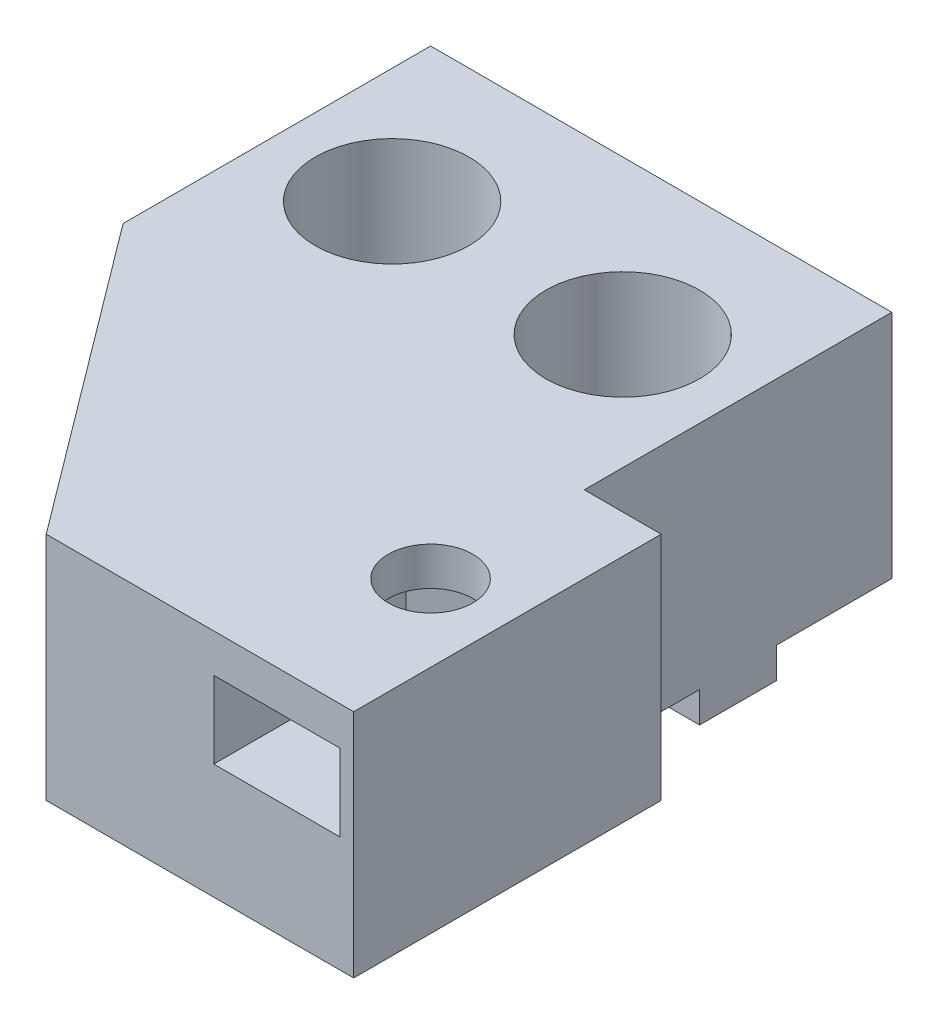
ISO-10303-21;
HEADER;
FILE_DESCRIPTION(('STEP AP214'),'2;1');
FILE_NAME('part.step','',(''),(''),'','','');
FILE_SCHEMA(('AUTOMOTIVE_DESIGN { 1 0 10303 214 1 1 1 1 }'));
ENDSEC;
DATA;
#1=APPLICATION_CONTEXT('core data for automotive mechanical design processes');
#2=APPLICATION_PROTOCOL_DEFINITION('international standard','automotive_design',2000,#1);
#3=PRODUCT_CONTEXT('',#1,'mechanical');
#4=PRODUCT('Part','Part','',(#3));
#5=PRODUCT_RELATED_PRODUCT_CATEGORY('part','',(#4));
#6=PRODUCT_DEFINITION_FORMATION('','',#4);
#7=PRODUCT_DEFINITION_CONTEXT('part definition',#1,'design');
#8=PRODUCT_DEFINITION('design','',#6,#7);
#9=PRODUCT_DEFINITION_SHAPE('','',#8);
#10=(LENGTH_UNIT() NAMED_UNIT(*) SI_UNIT(.MILLI.,.METRE.));
#11=(NAMED_UNIT(*) PLANE_ANGLE_UNIT() SI_UNIT($,.RADIAN.));
#12=(NAMED_UNIT(*) SI_UNIT($,.STERADIAN.) SOLID_ANGLE_UNIT());
#13=UNCERTAINTY_MEASURE_WITH_UNIT(LENGTH_MEASURE(1.E-05),#10,'distance_accuracy_value','');
#14=(GEOMETRIC_REPRESENTATION_CONTEXT(3) GLOBAL_UNCERTAINTY_ASSIGNED_CONTEXT((#13)) GLOBAL_UNIT_ASSIGNED_CONTEXT((#10,
#11,#12)) REPRESENTATION_CONTEXT('',''));
#15=CARTESIAN_POINT('',(0.,0.,0.));
#16=DIRECTION('',(0.,0.,1.));
#17=DIRECTION('',(1.,0.,0.));
#18=AXIS2_PLACEMENT_3D('',#15,#16,#17);
#19=CARTESIAN_POINT('',(-7.5,-2.,-10.));
#20=DIRECTION('',(0.,1.,0.));
#21=DIRECTION('',(0.,0.,1.));
#22=AXIS2_PLACEMENT_3D('',#19,#20,#21);
#23=CYLINDRICAL_SURFACE('',#22,2.75);
#24=CARTESIAN_POINT('',(-7.5,0.,-10.));
#25=DIRECTION('',(0.,1.,0.));
#26=DIRECTION('',(0.,0.,1.));
#27=AXIS2_PLACEMENT_3D('',#24,#25,#26);
#28=CIRCLE('',#27,2.75);
#29=CARTESIAN_POINT('',(-7.5,0.,-7.25));
#30=VERTEX_POINT('',#29);
#31=EDGE_CURVE('E235',#30,#30,#28,.T.);
#32=ORIENTED_EDGE('',*,*,#31,.F.);
#33=EDGE_LOOP('',(#32));
#34=FACE_BOUND('',#33,.T.);
#35=CARTESIAN_POINT('',(-7.5,5.,-10.));
#36=DIRECTION('',(0.,1.,0.));
#37=DIRECTION('',(0.,0.,1.));
#38=AXIS2_PLACEMENT_3D('',#35,#36,#37);
#39=CIRCLE('',#38,2.75);
#40=CARTESIAN_POINT('',(-7.5,5.,-7.25));
#41=VERTEX_POINT('',#40);
#42=EDGE_CURVE('E237',#41,#41,#39,.F.);
#43=ORIENTED_EDGE('',*,*,#42,.F.);
#44=EDGE_LOOP('',(#43));
#45=FACE_BOUND('',#44,.T.);
#46=ADVANCED_FACE('F35',(#34,#45),#23,.F.);
#47=CARTESIAN_POINT('',(7.5,-2.,-10.));
#48=DIRECTION('',(0.,1.,0.));
#49=DIRECTION('',(0.,0.,1.));
#50=AXIS2_PLACEMENT_3D('',#47,#48,#49);
#51=CYLINDRICAL_SURFACE('',#50,2.75);
#52=CARTESIAN_POINT('',(7.5,0.,-10.));
#53=DIRECTION('',(0.,1.,0.));
#54=DIRECTION('',(0.,0.,1.));
#55=AXIS2_PLACEMENT_3D('',#52,#53,#54);
#56=CIRCLE('',#55,2.75);
#57=CARTESIAN_POINT('',(7.5,0.,-7.25));
#58=VERTEX_POINT('',#57);
#59=EDGE_CURVE('E356',#58,#58,#56,.T.);
#60=ORIENTED_EDGE('',*,*,#59,.F.);
#61=EDGE_LOOP('',(#60));
#62=FACE_BOUND('',#61,.T.);
#63=CARTESIAN_POINT('',(7.5,5.,-10.));
#64=DIRECTION('',(0.,1.,0.));
#65=DIRECTION('',(0.,0.,1.));
#66=AXIS2_PLACEMENT_3D('',#63,#64,#65);
#67=CIRCLE('',#66,2.75);
#68=CARTESIAN_POINT('',(7.5,5.,-7.25));
#69=VERTEX_POINT('',#68);
#70=EDGE_CURVE('E232',#69,#69,#67,.F.);
#71=ORIENTED_EDGE('',*,*,#70,.F.);
#72=EDGE_LOOP('',(#71));
#73=FACE_BOUND('',#72,.T.);
#74=ADVANCED_FACE('F477',(#62,#73),#51,.F.);
#75=CARTESIAN_POINT('',(15.,-2.,-7.5));
#76=DIRECTION('',(0.,0.,-1.));
#77=DIRECTION('',(-1.,0.,0.));
#78=AXIS2_PLACEMENT_3D('',#75,#76,#77);
#79=PLANE('',#78);
#80=DIRECTION('',(-1.,0.,0.));
#81=VECTOR('',#80,1.);
#82=CARTESIAN_POINT('',(15.,-2.,-7.5));
#83=LINE('',#82,#81);
#84=CARTESIAN_POINT('',(-12.9543560573179,-2.,-7.50000000000001));
#85=VERTEX_POINT('',#84);
#86=CARTESIAN_POINT('',(-15.,-2.,-7.5));
#87=VERTEX_POINT('',#86);
#88=EDGE_CURVE('E353',#85,#87,#83,.T.);
#89=ORIENTED_EDGE('',*,*,#88,.F.);
#90=DIRECTION('',(0.,-1.,0.));
#91=VECTOR('',#90,1.);
#92=CARTESIAN_POINT('',(-12.9543560573179,16.9705627484771,-7.5));
#93=LINE('',#92,#91);
#94=CARTESIAN_POINT('',(-12.9543560573179,0.,-7.50000000000001));
#95=VERTEX_POINT('',#94);
#96=EDGE_CURVE('E370',#85,#95,#93,.F.);
#97=ORIENTED_EDGE('',*,*,#96,.T.);
#98=DIRECTION('',(-1.,0.,0.));
#99=VECTOR('',#98,1.);
#100=CARTESIAN_POINT('',(15.,0.,-7.5));
#101=LINE('',#100,#99);
#102=CARTESIAN_POINT('',(-15.,0.,-7.5));
#103=VERTEX_POINT('',#102);
#104=EDGE_CURVE('E342',#95,#103,#101,.T.);
#105=ORIENTED_EDGE('',*,*,#104,.T.);
#106=DIRECTION('',(0.,1.,0.));
#107=VECTOR('',#106,1.);
#108=CARTESIAN_POINT('',(-15.,-2.,-7.5));
#109=LINE('',#108,#107);
#110=EDGE_CURVE('E322',#87,#103,#109,.T.);
#111=ORIENTED_EDGE('',*,*,#110,.F.);
#112=EDGE_LOOP('',(#89,#97,#105,#111));
#113=FACE_BOUND('',#112,.T.);
#114=ADVANCED_FACE('F435',(#113),#79,.F.);
#115=CARTESIAN_POINT('',(15.,-2.,-12.5));
#116=DIRECTION('',(0.,0.,1.));
#117=DIRECTION('',(1.,0.,0.));
#118=AXIS2_PLACEMENT_3D('',#115,#116,#117);
#119=PLANE('',#118);
#120=DIRECTION('',(1.,0.,0.));
#121=VECTOR('',#120,1.);
#122=CARTESIAN_POINT('',(15.,0.,-12.5));
#123=LINE('',#122,#121);
#124=CARTESIAN_POINT('',(-2.04564394268214,0.,-12.5));
#125=VERTEX_POINT('',#124);
#126=CARTESIAN_POINT('',(2.04564394268214,0.,-12.5));
#127=VERTEX_POINT('',#126);
#128=EDGE_CURVE('E336',#125,#127,#123,.T.);
#129=ORIENTED_EDGE('',*,*,#128,.T.);
#130=DIRECTION('',(0.,-1.,0.));
#131=VECTOR('',#130,1.);
#132=CARTESIAN_POINT('',(2.04564394268214,16.9705627484771,-12.5));
#133=LINE('',#132,#131);
#134=CARTESIAN_POINT('',(2.04564394268214,-2.,-12.5));
#135=VERTEX_POINT('',#134);
#136=EDGE_CURVE('E388',#127,#135,#133,.T.);
#137=ORIENTED_EDGE('',*,*,#136,.T.);
#138=DIRECTION('',(1.,0.,0.));
#139=VECTOR('',#138,1.);
#140=CARTESIAN_POINT('',(15.,-2.,-12.5));
#141=LINE('',#140,#139);
#142=CARTESIAN_POINT('',(-2.04564394268214,-2.,-12.5));
#143=VERTEX_POINT('',#142);
#144=EDGE_CURVE('E345',#143,#135,#141,.T.);
#145=ORIENTED_EDGE('',*,*,#144,.F.);
#146=DIRECTION('',(0.,-1.,0.));
#147=VECTOR('',#146,1.);
#148=CARTESIAN_POINT('',(-2.04564394268214,16.9705627484771,-12.5));
#149=LINE('',#148,#147);
#150=EDGE_CURVE('E373',#143,#125,#149,.F.);
#151=ORIENTED_EDGE('',*,*,#150,.T.);
#152=EDGE_LOOP('',(#129,#137,#145,#151));
#153=FACE_BOUND('',#152,.T.);
#154=ADVANCED_FACE('F464',(#153),#119,.F.);
#155=CARTESIAN_POINT('',(0.,-2.,0.));
#156=DIRECTION('',(0.,-1.,0.));
#157=DIRECTION('',(0.,0.,-1.));
#158=AXIS2_PLACEMENT_3D('',#155,#156,#157);
#159=PLANE('',#158);
#160=CARTESIAN_POINT('',(7.5,-2.,-10.));
#161=DIRECTION('',(0.,-1.,0.));
#162=DIRECTION('',(0.,0.,-1.));
#163=AXIS2_PLACEMENT_3D('',#160,#161,#162);
#164=CIRCLE('',#163,6.);
#165=CARTESIAN_POINT('',(2.04564394268214,-2.,-7.5));
#166=VERTEX_POINT('',#165);
#167=EDGE_CURVE('E400',#166,#135,#164,.T.);
#168=ORIENTED_EDGE('',*,*,#167,.F.);
#169=CARTESIAN_POINT('',(-2.04564394268213,-2.,-7.5));
#170=VERTEX_POINT('',#169);
#171=EDGE_CURVE('E352',#166,#170,#83,.T.);
#172=ORIENTED_EDGE('',*,*,#171,.T.);
#173=CARTESIAN_POINT('',(-7.5,-2.,-10.));
#174=DIRECTION('',(0.,-1.,0.));
#175=DIRECTION('',(0.,0.,-1.));
#176=AXIS2_PLACEMENT_3D('',#173,#174,#175);
#177=CIRCLE('',#176,6.);
#178=EDGE_CURVE('E385',#143,#170,#177,.T.);
#179=ORIENTED_EDGE('',*,*,#178,.F.);
#180=ORIENTED_EDGE('',*,*,#144,.T.);
#181=EDGE_LOOP('',(#168,#172,#179,#180));
#182=FACE_BOUND('',#181,.T.);
#183=ADVANCED_FACE('F463',(#182),#159,.T.);
#184=ORIENTED_EDGE('',*,*,#171,.F.);
#185=DIRECTION('',(0.,-1.,0.));
#186=VECTOR('',#185,1.);
#187=CARTESIAN_POINT('',(2.04564394268214,16.9705627484771,-7.5));
#188=LINE('',#187,#186);
#189=CARTESIAN_POINT('',(2.04564394268214,0.,-7.5));
#190=VERTEX_POINT('',#189);
#191=EDGE_CURVE('E391',#166,#190,#188,.F.);
#192=ORIENTED_EDGE('',*,*,#191,.T.);
#193=CARTESIAN_POINT('',(-2.04564394268214,0.,-7.50000000000001));
#194=VERTEX_POINT('',#193);
#195=EDGE_CURVE('E341',#190,#194,#101,.T.);
#196=ORIENTED_EDGE('',*,*,#195,.T.);
#197=DIRECTION('',(0.,-1.,0.));
#198=VECTOR('',#197,1.);
#199=CARTESIAN_POINT('',(-2.04564394268214,16.9705627484771,-7.5));
#200=LINE('',#199,#198);
#201=EDGE_CURVE('E376',#194,#170,#200,.T.);
#202=ORIENTED_EDGE('',*,*,#201,.T.);
#203=EDGE_LOOP('',(#184,#192,#196,#202));
#204=FACE_BOUND('',#203,.T.);
#205=ADVANCED_FACE('F440',(#204),#79,.F.);
#206=CARTESIAN_POINT('',(12.9543560573179,-2.,-12.5));
#207=VERTEX_POINT('',#206);
#208=CARTESIAN_POINT('',(15.,-2.,-12.5));
#209=VERTEX_POINT('',#208);
#210=EDGE_CURVE('E346',#207,#209,#141,.T.);
#211=ORIENTED_EDGE('',*,*,#210,.F.);
#212=DIRECTION('',(0.,-1.,0.));
#213=VECTOR('',#212,1.);
#214=CARTESIAN_POINT('',(12.9543560573179,16.9705627484771,-12.5));
#215=LINE('',#214,#213);
#216=CARTESIAN_POINT('',(12.9543560573179,0.,-12.5));
#217=VERTEX_POINT('',#216);
#218=EDGE_CURVE('E393',#207,#217,#215,.F.);
#219=ORIENTED_EDGE('',*,*,#218,.T.);
#220=CARTESIAN_POINT('',(15.,0.,-12.5));
#221=VERTEX_POINT('',#220);
#222=EDGE_CURVE('E337',#217,#221,#123,.T.);
#223=ORIENTED_EDGE('',*,*,#222,.T.);
#224=DIRECTION('',(0.,1.,0.));
#225=VECTOR('',#224,1.);
#226=CARTESIAN_POINT('',(15.,-2.,-12.5));
#227=LINE('',#226,#225);
#228=EDGE_CURVE('E328',#209,#221,#227,.T.);
#229=ORIENTED_EDGE('',*,*,#228,.F.);
#230=EDGE_LOOP('',(#211,#219,#223,#229));
#231=FACE_BOUND('',#230,.T.);
#232=ADVANCED_FACE('F453',(#231),#119,.F.);
#233=CARTESIAN_POINT('',(12.9543560573179,-2.,-7.5));
#234=VERTEX_POINT('',#233);
#235=EDGE_CURVE('E398',#207,#234,#164,.T.);
#236=ORIENTED_EDGE('',*,*,#235,.F.);
#237=ORIENTED_EDGE('',*,*,#210,.T.);
#238=DIRECTION('',(0.,0.,1.));
#239=VECTOR('',#238,1.);
#240=CARTESIAN_POINT('',(15.,-2.,-12.5));
#241=LINE('',#240,#239);
#242=CARTESIAN_POINT('',(15.,-2.,-7.5));
#243=VERTEX_POINT('',#242);
#244=EDGE_CURVE('E335',#209,#243,#241,.T.);
#245=ORIENTED_EDGE('',*,*,#244,.T.);
#246=EDGE_CURVE('E349',#243,#234,#83,.T.);
#247=ORIENTED_EDGE('',*,*,#246,.T.);
#248=EDGE_LOOP('',(#236,#237,#245,#247));
#249=FACE_BOUND('',#248,.T.);
#250=ADVANCED_FACE('F458',(#249),#159,.T.);
#251=CARTESIAN_POINT('',(0.,0.,20.));
#252=DIRECTION('',(0.,1.,0.));
#253=DIRECTION('',(0.,0.,1.));
#254=AXIS2_PLACEMENT_3D('',#251,#252,#253);
#255=PLANE('',#254);
#256=CARTESIAN_POINT('',(7.5,0.,-10.));
#257=DIRECTION('',(0.,1.,0.));
#258=DIRECTION('',(0.,0.,1.));
#259=AXIS2_PLACEMENT_3D('',#256,#257,#258);
#260=CIRCLE('',#259,6.);
#261=EDGE_CURVE('E58',#190,#127,#260,.F.);
#262=ORIENTED_EDGE('',*,*,#261,.T.);
#263=ORIENTED_EDGE('',*,*,#128,.F.);
#264=CARTESIAN_POINT('',(-7.5,0.,-10.));
#265=DIRECTION('',(0.,1.,0.));
#266=DIRECTION('',(0.,0.,1.));
#267=AXIS2_PLACEMENT_3D('',#264,#265,#266);
#268=CIRCLE('',#267,6.);
#269=EDGE_CURVE('E384',#125,#194,#268,.F.);
#270=ORIENTED_EDGE('',*,*,#269,.T.);
#271=ORIENTED_EDGE('',*,*,#195,.F.);
#272=EDGE_LOOP('',(#262,#263,#270,#271));
#273=FACE_BOUND('',#272,.T.);
#274=DIRECTION('',(1.,0.,0.));
#275=VECTOR('',#274,1.);
#276=CARTESIAN_POINT('',(0.,0.,0.));
#277=LINE('',#276,#275);
#278=CARTESIAN_POINT('',(15.,0.,0.));
#279=VERTEX_POINT('',#278);
#280=CARTESIAN_POINT('',(20.,0.,0.));
#281=VERTEX_POINT('',#280);
#282=EDGE_CURVE('E218',#279,#281,#277,.T.);
#283=ORIENTED_EDGE('',*,*,#282,.T.);
#284=DIRECTION('',(0.,0.,-1.));
#285=VECTOR('',#284,1.);
#286=CARTESIAN_POINT('',(20.,0.,0.));
#287=LINE('',#286,#285);
#288=CARTESIAN_POINT('',(20.,0.,20.));
#289=VERTEX_POINT('',#288);
#290=EDGE_CURVE('E50',#289,#281,#287,.T.);
#291=ORIENTED_EDGE('',*,*,#290,.F.);
#292=DIRECTION('',(1.,0.,0.));
#293=VECTOR('',#292,1.);
#294=CARTESIAN_POINT('',(0.,0.,20.));
#295=LINE('',#294,#293);
#296=CARTESIAN_POINT('',(0.,0.,20.));
#297=VERTEX_POINT('',#296);
#298=EDGE_CURVE('E221',#297,#289,#295,.T.);
#299=ORIENTED_EDGE('',*,*,#298,.F.);
#300=DIRECTION('',(-0.6,0.,-0.8));
#301=VECTOR('',#300,1.);
#302=CARTESIAN_POINT('',(-15.,0.,0.));
#303=LINE('',#302,#301);
#304=CARTESIAN_POINT('',(-15.,0.,0.));
#305=VERTEX_POINT('',#304);
#306=EDGE_CURVE('E401',#297,#305,#303,.T.);
#307=ORIENTED_EDGE('',*,*,#306,.T.);
#308=DIRECTION('',(0.,0.,1.));
#309=VECTOR('',#308,1.);
#310=CARTESIAN_POINT('',(-15.,0.,-20.));
#311=LINE('',#310,#309);
#312=EDGE_CURVE('E300',#103,#305,#311,.T.);
#313=ORIENTED_EDGE('',*,*,#312,.F.);
#314=ORIENTED_EDGE('',*,*,#104,.F.);
#315=CARTESIAN_POINT('',(-12.9543560573179,0.,-12.5));
#316=VERTEX_POINT('',#315);
#317=EDGE_CURVE('E381',#95,#316,#268,.F.);
#318=ORIENTED_EDGE('',*,*,#317,.T.);
#319=CARTESIAN_POINT('',(-15.,0.,-12.5));
#320=VERTEX_POINT('',#319);
#321=EDGE_CURVE('E332',#320,#316,#123,.T.);
#322=ORIENTED_EDGE('',*,*,#321,.F.);
#323=CARTESIAN_POINT('',(-15.,0.,-20.));
#324=VERTEX_POINT('',#323);
#325=EDGE_CURVE('E297',#324,#320,#311,.T.);
#326=ORIENTED_EDGE('',*,*,#325,.F.);
#327=DIRECTION('',(-1.,0.,0.));
#328=VECTOR('',#327,1.);
#329=CARTESIAN_POINT('',(15.,0.,-20.));
#330=LINE('',#329,#328);
#331=CARTESIAN_POINT('',(15.,0.,-20.));
#332=VERTEX_POINT('',#331);
#333=EDGE_CURVE('E316',#332,#324,#330,.T.);
#334=ORIENTED_EDGE('',*,*,#333,.F.);
#335=DIRECTION('',(0.,0.,1.));
#336=VECTOR('',#335,1.);
#337=CARTESIAN_POINT('',(15.,0.,-20.));
#338=LINE('',#337,#336);
#339=EDGE_CURVE('E279',#332,#221,#338,.T.);
#340=ORIENTED_EDGE('',*,*,#339,.T.);
#341=ORIENTED_EDGE('',*,*,#222,.F.);
#342=CARTESIAN_POINT('',(12.9543560573179,0.,-7.5));
#343=VERTEX_POINT('',#342);
#344=EDGE_CURVE('E397',#217,#343,#260,.F.);
#345=ORIENTED_EDGE('',*,*,#344,.T.);
#346=CARTESIAN_POINT('',(15.,0.,-7.5));
#347=VERTEX_POINT('',#346);
#348=EDGE_CURVE('E338',#347,#343,#101,.T.);
#349=ORIENTED_EDGE('',*,*,#348,.F.);
#350=EDGE_CURVE('E296',#347,#279,#338,.T.);
#351=ORIENTED_EDGE('',*,*,#350,.T.);
#352=EDGE_LOOP('',(#283,#291,#299,#307,#313,#314,#318,#322,#326,#334,#340,#341,#345,#349,#351));
#353=FACE_BOUND('',#352,.T.);
#354=ORIENTED_EDGE('',*,*,#59,.T.);
#355=EDGE_LOOP('',(#354));
#356=FACE_BOUND('',#355,.T.);
#357=CARTESIAN_POINT('',(15.,0.,10.));
#358=DIRECTION('',(0.,1.,0.));
#359=DIRECTION('',(0.,0.,1.));
#360=AXIS2_PLACEMENT_3D('',#357,#358,#359);
#361=CIRCLE('',#360,2.75);
#362=CARTESIAN_POINT('',(15.,0.,12.75));
#363=VERTEX_POINT('',#362);
#364=EDGE_CURVE('E231',#363,#363,#361,.T.);
#365=ORIENTED_EDGE('',*,*,#364,.T.);
#366=EDGE_LOOP('',(#365));
#367=FACE_BOUND('',#366,.T.);
#368=ORIENTED_EDGE('',*,*,#31,.T.);
#369=EDGE_LOOP('',(#368));
#370=FACE_BOUND('',#369,.T.);
#371=ADVANCED_FACE('F37',(#273,#353,#356,#367,#370),#255,.F.);
#372=CARTESIAN_POINT('',(10.9,7.5,0.));
#373=DIRECTION('',(-1.,0.,0.));
#374=DIRECTION('',(0.,0.,1.));
#375=AXIS2_PLACEMENT_3D('',#372,#373,#374);
#376=PLANE('',#375);
#377=DIRECTION('',(0.,-1.,0.));
#378=VECTOR('',#377,1.);
#379=CARTESIAN_POINT('',(10.9,500000.,7.5));
#380=LINE('',#379,#378);
#381=CARTESIAN_POINT('',(10.9,12.5,7.5));
#382=VERTEX_POINT('',#381);
#383=CARTESIAN_POINT('',(10.9,7.5,7.5));
#384=VERTEX_POINT('',#383);
#385=EDGE_CURVE('E281',#382,#384,#380,.T.);
#386=ORIENTED_EDGE('',*,*,#385,.F.);
#387=DIRECTION('',(0.,0.,1.));
#388=VECTOR('',#387,1.);
#389=CARTESIAN_POINT('',(10.9,12.5,0.));
#390=LINE('',#389,#388);
#391=CARTESIAN_POINT('',(10.9,12.5,20.));
#392=VERTEX_POINT('',#391);
#393=EDGE_CURVE('E223',#382,#392,#390,.T.);
#394=ORIENTED_EDGE('',*,*,#393,.T.);
#395=DIRECTION('',(0.,-1.,0.));
#396=VECTOR('',#395,1.);
#397=CARTESIAN_POINT('',(10.9,7.5,20.));
#398=LINE('',#397,#396);
#399=CARTESIAN_POINT('',(10.9,7.5,20.));
#400=VERTEX_POINT('',#399);
#401=EDGE_CURVE('E265',#392,#400,#398,.T.);
#402=ORIENTED_EDGE('',*,*,#401,.T.);
#403=DIRECTION('',(0.,0.,1.));
#404=VECTOR('',#403,1.);
#405=CARTESIAN_POINT('',(10.9,7.5,0.));
#406=LINE('',#405,#404);
#407=EDGE_CURVE('E249',#384,#400,#406,.T.);
#408=ORIENTED_EDGE('',*,*,#407,.F.);
#409=EDGE_LOOP('',(#386,#394,#402,#408));
#410=FACE_BOUND('',#409,.T.);
#411=ADVANCED_FACE('F527',(#410),#376,.F.);
#412=CARTESIAN_POINT('',(10.9,12.5,0.));
#413=DIRECTION('',(0.,1.,0.));
#414=DIRECTION('',(0.,0.,1.));
#415=AXIS2_PLACEMENT_3D('',#412,#413,#414);
#416=PLANE('',#415);
#417=CARTESIAN_POINT('',(15.,12.5,10.));
#418=DIRECTION('',(0.,1.,0.));
#419=DIRECTION('',(0.,0.,1.));
#420=AXIS2_PLACEMENT_3D('',#417,#418,#419);
#421=CIRCLE('',#420,2.75);
#422=CARTESIAN_POINT('',(15.,12.5,12.75));
#423=VERTEX_POINT('',#422);
#424=EDGE_CURVE('E230',#423,#423,#421,.T.);
#425=ORIENTED_EDGE('',*,*,#424,.T.);
#426=EDGE_LOOP('',(#425));
#427=FACE_BOUND('',#426,.T.);
#428=DIRECTION('',(0.860696161220526,0.,0.509118962581684));
#429=VECTOR('',#428,1.);
#430=CARTESIAN_POINT('',(19.1,12.4999999999886,7.5));
#431=LINE('',#430,#429);
#432=CARTESIAN_POINT('',(15.1,12.5,5.13392014269139));
#433=VERTEX_POINT('',#432);
#434=CARTESIAN_POINT('',(19.1,12.5,7.5));
#435=VERTEX_POINT('',#434);
#436=EDGE_CURVE('E276',#433,#435,#431,.T.);
#437=ORIENTED_EDGE('',*,*,#436,.T.);
#438=DIRECTION('',(0.,0.,1.));
#439=VECTOR('',#438,1.);
#440=CARTESIAN_POINT('',(19.1,12.5,0.));
#441=LINE('',#440,#439);
#442=CARTESIAN_POINT('',(19.1,12.5,20.));
#443=VERTEX_POINT('',#442);
#444=EDGE_CURVE('E254',#435,#443,#441,.T.);
#445=ORIENTED_EDGE('',*,*,#444,.T.);
#446=DIRECTION('',(-1.,0.,0.));
#447=VECTOR('',#446,1.);
#448=CARTESIAN_POINT('',(10.9,12.5,20.));
#449=LINE('',#448,#447);
#450=EDGE_CURVE('E252',#443,#392,#449,.T.);
#451=ORIENTED_EDGE('',*,*,#450,.T.);
#452=ORIENTED_EDGE('',*,*,#393,.F.);
#453=DIRECTION('',(0.871258035754379,0.,-0.490825259265882));
#454=VECTOR('',#453,1.);
#455=CARTESIAN_POINT('',(15.1,12.4999999999886,5.13392014269138));
#456=LINE('',#455,#454);
#457=EDGE_CURVE('E278',#382,#433,#456,.T.);
#458=ORIENTED_EDGE('',*,*,#457,.T.);
#459=EDGE_LOOP('',(#437,#445,#451,#452,#458));
#460=FACE_BOUND('',#459,.T.);
#461=ADVANCED_FACE('F523',(#427,#460),#416,.F.);
#462=CARTESIAN_POINT('',(19.1,7.5,0.));
#463=DIRECTION('',(1.,0.,0.));
#464=DIRECTION('',(0.,0.,-1.));
#465=AXIS2_PLACEMENT_3D('',#462,#463,#464);
#466=PLANE('',#465);
#467=DIRECTION('',(0.,-1.,0.));
#468=VECTOR('',#467,1.);
#469=CARTESIAN_POINT('',(19.1,500000.,7.5));
#470=LINE('',#469,#468);
#471=CARTESIAN_POINT('',(19.1,7.5,7.5));
#472=VERTEX_POINT('',#471);
#473=EDGE_CURVE('E282',#435,#472,#470,.T.);
#474=ORIENTED_EDGE('',*,*,#473,.T.);
#475=DIRECTION('',(0.,0.,1.));
#476=VECTOR('',#475,1.);
#477=CARTESIAN_POINT('',(19.1,7.5,0.));
#478=LINE('',#477,#476);
#479=CARTESIAN_POINT('',(19.1,7.5,20.));
#480=VERTEX_POINT('',#479);
#481=EDGE_CURVE('E251',#472,#480,#478,.T.);
#482=ORIENTED_EDGE('',*,*,#481,.T.);
#483=DIRECTION('',(0.,1.,0.));
#484=VECTOR('',#483,1.);
#485=CARTESIAN_POINT('',(19.1,7.5,20.));
#486=LINE('',#485,#484);
#487=EDGE_CURVE('E259',#480,#443,#486,.T.);
#488=ORIENTED_EDGE('',*,*,#487,.T.);
#489=ORIENTED_EDGE('',*,*,#444,.F.);
#490=EDGE_LOOP('',(#474,#482,#488,#489));
#491=FACE_BOUND('',#490,.T.);
#492=ADVANCED_FACE('F526',(#491),#466,.F.);
#493=CARTESIAN_POINT('',(10.9,7.5,0.));
#494=DIRECTION('',(0.,-1.,0.));
#495=DIRECTION('',(0.,0.,-1.));
#496=AXIS2_PLACEMENT_3D('',#493,#494,#495);
#497=PLANE('',#496);
#498=CARTESIAN_POINT('',(15.,7.5,10.));
#499=DIRECTION('',(0.,-1.,0.));
#500=DIRECTION('',(0.,0.,-1.));
#501=AXIS2_PLACEMENT_3D('',#498,#499,#500);
#502=CIRCLE('',#501,2.75);
#503=CARTESIAN_POINT('',(15.,7.5,7.25));
#504=VERTEX_POINT('',#503);
#505=EDGE_CURVE('E227',#504,#504,#502,.T.);
#506=ORIENTED_EDGE('',*,*,#505,.T.);
#507=EDGE_LOOP('',(#506));
#508=FACE_BOUND('',#507,.T.);
#509=DIRECTION('',(0.860696161220526,0.,0.509118962581684));
#510=VECTOR('',#509,1.);
#511=CARTESIAN_POINT('',(19.1,7.5,7.5));
#512=LINE('',#511,#510);
#513=CARTESIAN_POINT('',(15.1,7.5,5.13392014269138));
#514=VERTEX_POINT('',#513);
#515=EDGE_CURVE('E284',#514,#472,#512,.T.);
#516=ORIENTED_EDGE('',*,*,#515,.F.);
#517=DIRECTION('',(0.871258035754379,0.,-0.490825259265882));
#518=VECTOR('',#517,1.);
#519=CARTESIAN_POINT('',(15.1,7.5,5.13392014269138));
#520=LINE('',#519,#518);
#521=EDGE_CURVE('E273',#384,#514,#520,.T.);
#522=ORIENTED_EDGE('',*,*,#521,.F.);
#523=ORIENTED_EDGE('',*,*,#407,.T.);
#524=DIRECTION('',(1.,0.,0.));
#525=VECTOR('',#524,1.);
#526=CARTESIAN_POINT('',(10.9,7.5,20.));
#527=LINE('',#526,#525);
#528=EDGE_CURVE('E262',#400,#480,#527,.T.);
#529=ORIENTED_EDGE('',*,*,#528,.T.);
#530=ORIENTED_EDGE('',*,*,#481,.F.);
#531=EDGE_LOOP('',(#516,#522,#523,#529,#530));
#532=FACE_BOUND('',#531,.T.);
#533=ADVANCED_FACE('F531',(#508,#532),#497,.F.);
#534=CARTESIAN_POINT('',(0.,15.,20.));
#535=DIRECTION('',(0.,-1.,0.));
#536=DIRECTION('',(0.,0.,-1.));
#537=AXIS2_PLACEMENT_3D('',#534,#535,#536);
#538=PLANE('',#537);
#539=CARTESIAN_POINT('',(-7.5,15.,-10.));
#540=DIRECTION('',(0.,1.,0.));
#541=DIRECTION('',(0.,0.,1.));
#542=AXIS2_PLACEMENT_3D('',#539,#540,#541);
#543=CIRCLE('',#542,5.);
#544=CARTESIAN_POINT('',(-7.5,15.,-5.));
#545=VERTEX_POINT('',#544);
#546=EDGE_CURVE('E367',#545,#545,#543,.T.);
#547=ORIENTED_EDGE('',*,*,#546,.F.);
#548=EDGE_LOOP('',(#547));
#549=FACE_BOUND('',#548,.T.);
#550=CARTESIAN_POINT('',(7.5,15.,-10.));
#551=DIRECTION('',(0.,1.,0.));
#552=DIRECTION('',(0.,0.,1.));
#553=AXIS2_PLACEMENT_3D('',#550,#551,#552);
#554=CIRCLE('',#553,5.);
#555=CARTESIAN_POINT('',(7.5,15.,-5.));
#556=VERTEX_POINT('',#555);
#557=EDGE_CURVE('E239',#556,#556,#554,.T.);
#558=ORIENTED_EDGE('',*,*,#557,.F.);
#559=EDGE_LOOP('',(#558));
#560=FACE_BOUND('',#559,.T.);
#561=CARTESIAN_POINT('',(15.,15.,10.));
#562=DIRECTION('',(0.,1.,0.));
#563=DIRECTION('',(0.,0.,1.));
#564=AXIS2_PLACEMENT_3D('',#561,#562,#563);
#565=CIRCLE('',#564,2.75);
#566=CARTESIAN_POINT('',(15.,15.,12.75));
#567=VERTEX_POINT('',#566);
#568=EDGE_CURVE('E270',#567,#567,#565,.T.);
#569=ORIENTED_EDGE('',*,*,#568,.F.);
#570=EDGE_LOOP('',(#569));
#571=FACE_BOUND('',#570,.T.);
#572=DIRECTION('',(-1.,0.,0.));
#573=VECTOR('',#572,1.);
#574=CARTESIAN_POINT('',(0.,15.,20.));
#575=LINE('',#574,#573);
#576=CARTESIAN_POINT('',(20.,15.,20.));
#577=VERTEX_POINT('',#576);
#578=CARTESIAN_POINT('',(0.,15.,20.));
#579=VERTEX_POINT('',#578);
#580=EDGE_CURVE('E211',#577,#579,#575,.T.);
#581=ORIENTED_EDGE('',*,*,#580,.F.);
#582=DIRECTION('',(0.,0.,1.));
#583=VECTOR('',#582,1.);
#584=CARTESIAN_POINT('',(20.,15.,0.));
#585=LINE('',#584,#583);
#586=CARTESIAN_POINT('',(20.,15.,0.));
#587=VERTEX_POINT('',#586);
#588=EDGE_CURVE('E196',#587,#577,#585,.T.);
#589=ORIENTED_EDGE('',*,*,#588,.F.);
#590=DIRECTION('',(-1.,0.,0.));
#591=VECTOR('',#590,1.);
#592=CARTESIAN_POINT('',(0.,15.,0.));
#593=LINE('',#592,#591);
#594=CARTESIAN_POINT('',(15.,15.,0.));
#595=VERTEX_POINT('',#594);
#596=EDGE_CURVE('E208',#587,#595,#593,.T.);
#597=ORIENTED_EDGE('',*,*,#596,.T.);
#598=DIRECTION('',(0.,0.,1.));
#599=VECTOR('',#598,1.);
#600=CARTESIAN_POINT('',(15.,15.,-20.));
#601=LINE('',#600,#599);
#602=CARTESIAN_POINT('',(15.,15.,-20.));
#603=VERTEX_POINT('',#602);
#604=EDGE_CURVE('E304',#603,#595,#601,.T.);
#605=ORIENTED_EDGE('',*,*,#604,.F.);
#606=DIRECTION('',(1.,0.,0.));
#607=VECTOR('',#606,1.);
#608=CARTESIAN_POINT('',(15.,15.,-20.));
#609=LINE('',#608,#607);
#610=CARTESIAN_POINT('',(-15.,15.,-20.));
#611=VERTEX_POINT('',#610);
#612=EDGE_CURVE('E306',#611,#603,#609,.T.);
#613=ORIENTED_EDGE('',*,*,#612,.F.);
#614=DIRECTION('',(0.,0.,1.));
#615=VECTOR('',#614,1.);
#616=CARTESIAN_POINT('',(-15.,15.,-20.));
#617=LINE('',#616,#615);
#618=CARTESIAN_POINT('',(-15.,15.,0.));
#619=VERTEX_POINT('',#618);
#620=EDGE_CURVE('E301',#611,#619,#617,.T.);
#621=ORIENTED_EDGE('',*,*,#620,.T.);
#622=DIRECTION('',(0.6,0.,0.8));
#623=VECTOR('',#622,1.);
#624=CARTESIAN_POINT('',(-15.,15.,0.));
#625=LINE('',#624,#623);
#626=EDGE_CURVE('E404',#619,#579,#625,.T.);
#627=ORIENTED_EDGE('',*,*,#626,.T.);
#628=EDGE_LOOP('',(#581,#589,#597,#605,#613,#621,#627));
#629=FACE_BOUND('',#628,.T.);
#630=ADVANCED_FACE('F206',(#549,#560,#571,#629),#538,.F.);
#631=CARTESIAN_POINT('',(0.,0.,20.));
#632=DIRECTION('',(0.,0.,-1.));
#633=DIRECTION('',(-1.,0.,0.));
#634=AXIS2_PLACEMENT_3D('',#631,#632,#633);
#635=PLANE('',#634);
#636=ORIENTED_EDGE('',*,*,#528,.F.);
#637=ORIENTED_EDGE('',*,*,#401,.F.);
#638=ORIENTED_EDGE('',*,*,#450,.F.);
#639=ORIENTED_EDGE('',*,*,#487,.F.);
#640=EDGE_LOOP('',(#636,#637,#638,#639));
#641=FACE_BOUND('',#640,.T.);
#642=ORIENTED_EDGE('',*,*,#298,.T.);
#643=DIRECTION('',(0.,1.,0.));
#644=VECTOR('',#643,1.);
#645=CARTESIAN_POINT('',(20.,-22.3606797749979,20.));
#646=LINE('',#645,#644);
#647=EDGE_CURVE('E202',#289,#577,#646,.T.);
#648=ORIENTED_EDGE('',*,*,#647,.T.);
#649=ORIENTED_EDGE('',*,*,#580,.T.);
#650=DIRECTION('',(0.,-1.,0.));
#651=VECTOR('',#650,1.);
#652=CARTESIAN_POINT('',(0.,0.,20.));
#653=LINE('',#652,#651);
#654=EDGE_CURVE('E217',#579,#297,#653,.T.);
#655=ORIENTED_EDGE('',*,*,#654,.T.);
#656=EDGE_LOOP('',(#642,#648,#649,#655));
#657=FACE_BOUND('',#656,.T.);
#658=ADVANCED_FACE('F407',(#641,#657),#635,.F.);
#659=CARTESIAN_POINT('',(0.,0.,0.));
#660=DIRECTION('',(0.,0.,-1.));
#661=DIRECTION('',(-1.,0.,0.));
#662=AXIS2_PLACEMENT_3D('',#659,#660,#661);
#663=PLANE('',#662);
#664=DIRECTION('',(0.,1.,0.));
#665=VECTOR('',#664,1.);
#666=CARTESIAN_POINT('',(20.,-22.3606797749979,0.));
#667=LINE('',#666,#665);
#668=EDGE_CURVE('E193',#281,#587,#667,.T.);
#669=ORIENTED_EDGE('',*,*,#668,.F.);
#670=ORIENTED_EDGE('',*,*,#282,.F.);
#671=DIRECTION('',(0.,-1.,0.));
#672=VECTOR('',#671,1.);
#673=CARTESIAN_POINT('',(15.,15.,0.));
#674=LINE('',#673,#672);
#675=EDGE_CURVE('E215',#595,#279,#674,.T.);
#676=ORIENTED_EDGE('',*,*,#675,.F.);
#677=ORIENTED_EDGE('',*,*,#596,.F.);
#678=EDGE_LOOP('',(#669,#670,#676,#677));
#679=FACE_BOUND('',#678,.T.);
#680=ADVANCED_FACE('F213',(#679),#663,.T.);
#681=CARTESIAN_POINT('',(15.,0.,10.));
#682=DIRECTION('',(0.,1.,0.));
#683=DIRECTION('',(0.,0.,1.));
#684=AXIS2_PLACEMENT_3D('',#681,#682,#683);
#685=CYLINDRICAL_SURFACE('',#684,2.75);
#686=ORIENTED_EDGE('',*,*,#364,.F.);
#687=EDGE_LOOP('',(#686));
#688=FACE_BOUND('',#687,.T.);
#689=ORIENTED_EDGE('',*,*,#505,.F.);
#690=EDGE_LOOP('',(#689));
#691=FACE_BOUND('',#690,.T.);
#692=ADVANCED_FACE('F521',(#688,#691),#685,.F.);
#693=ORIENTED_EDGE('',*,*,#568,.T.);
#694=EDGE_LOOP('',(#693));
#695=FACE_BOUND('',#694,.T.);
#696=ORIENTED_EDGE('',*,*,#424,.F.);
#697=EDGE_LOOP('',(#696));
#698=FACE_BOUND('',#697,.T.);
#699=ADVANCED_FACE('F517',(#695,#698),#685,.F.);
#700=CARTESIAN_POINT('',(15.1,500000.,5.13392014269138));
#701=DIRECTION('',(-0.490825259265882,0.,-0.871258035754379));
#702=DIRECTION('',(-0.871258035754379,0.,0.490825259265882));
#703=AXIS2_PLACEMENT_3D('',#700,#701,#702);
#704=PLANE('',#703);
#705=ORIENTED_EDGE('',*,*,#457,.F.);
#706=ORIENTED_EDGE('',*,*,#385,.T.);
#707=ORIENTED_EDGE('',*,*,#521,.T.);
#708=DIRECTION('',(0.,-1.,0.));
#709=VECTOR('',#708,1.);
#710=CARTESIAN_POINT('',(15.1,500000.,5.13392014269138));
#711=LINE('',#710,#709);
#712=EDGE_CURVE('E285',#433,#514,#711,.T.);
#713=ORIENTED_EDGE('',*,*,#712,.F.);
#714=EDGE_LOOP('',(#705,#706,#707,#713));
#715=FACE_BOUND('',#714,.T.);
#716=ADVANCED_FACE('F513',(#715),#704,.F.);
#717=CARTESIAN_POINT('',(19.1,500000.,7.5));
#718=DIRECTION('',(0.509118962581684,0.,-0.860696161220526));
#719=DIRECTION('',(-0.860696161220526,0.,-0.509118962581684));
#720=AXIS2_PLACEMENT_3D('',#717,#718,#719);
#721=PLANE('',#720);
#722=ORIENTED_EDGE('',*,*,#436,.F.);
#723=ORIENTED_EDGE('',*,*,#712,.T.);
#724=ORIENTED_EDGE('',*,*,#515,.T.);
#725=ORIENTED_EDGE('',*,*,#473,.F.);
#726=EDGE_LOOP('',(#722,#723,#724,#725));
#727=FACE_BOUND('',#726,.T.);
#728=ADVANCED_FACE('F510',(#727),#721,.F.);
#729=CARTESIAN_POINT('',(15.,15.,-20.));
#730=DIRECTION('',(-1.,0.,0.));
#731=DIRECTION('',(0.,0.,1.));
#732=AXIS2_PLACEMENT_3D('',#729,#730,#731);
#733=PLANE('',#732);
#734=ORIENTED_EDGE('',*,*,#675,.T.);
#735=ORIENTED_EDGE('',*,*,#350,.F.);
#736=DIRECTION('',(0.,1.,0.));
#737=VECTOR('',#736,1.);
#738=CARTESIAN_POINT('',(15.,-2.,-7.5));
#739=LINE('',#738,#737);
#740=EDGE_CURVE('E312',#243,#347,#739,.T.);
#741=ORIENTED_EDGE('',*,*,#740,.F.);
#742=ORIENTED_EDGE('',*,*,#244,.F.);
#743=ORIENTED_EDGE('',*,*,#228,.T.);
#744=ORIENTED_EDGE('',*,*,#339,.F.);
#745=DIRECTION('',(0.,-1.,0.));
#746=VECTOR('',#745,1.);
#747=CARTESIAN_POINT('',(15.,15.,-20.));
#748=LINE('',#747,#746);
#749=EDGE_CURVE('E310',#603,#332,#748,.T.);
#750=ORIENTED_EDGE('',*,*,#749,.F.);
#751=ORIENTED_EDGE('',*,*,#604,.T.);
#752=EDGE_LOOP('',(#734,#735,#741,#742,#743,#744,#750,#751));
#753=FACE_BOUND('',#752,.T.);
#754=ADVANCED_FACE('F413',(#753),#733,.F.);
#755=CARTESIAN_POINT('',(-15.,15.,-20.));
#756=DIRECTION('',(1.,0.,0.));
#757=DIRECTION('',(0.,1.,0.));
#758=AXIS2_PLACEMENT_3D('',#755,#756,#757);
#759=PLANE('',#758);
#760=DIRECTION('',(0.,1.,0.));
#761=VECTOR('',#760,1.);
#762=CARTESIAN_POINT('',(-15.,15.,0.));
#763=LINE('',#762,#761);
#764=EDGE_CURVE('E307',#305,#619,#763,.T.);
#765=ORIENTED_EDGE('',*,*,#764,.T.);
#766=ORIENTED_EDGE('',*,*,#620,.F.);
#767=DIRECTION('',(0.,1.,0.));
#768=VECTOR('',#767,1.);
#769=CARTESIAN_POINT('',(-15.,15.,-20.));
#770=LINE('',#769,#768);
#771=EDGE_CURVE('E314',#324,#611,#770,.T.);
#772=ORIENTED_EDGE('',*,*,#771,.F.);
#773=ORIENTED_EDGE('',*,*,#325,.T.);
#774=DIRECTION('',(0.,1.,0.));
#775=VECTOR('',#774,1.);
#776=CARTESIAN_POINT('',(-15.,-2.,-12.5));
#777=LINE('',#776,#775);
#778=CARTESIAN_POINT('',(-15.,-2.,-12.5));
#779=VERTEX_POINT('',#778);
#780=EDGE_CURVE('E325',#779,#320,#777,.T.);
#781=ORIENTED_EDGE('',*,*,#780,.F.);
#782=DIRECTION('',(0.,0.,-1.));
#783=VECTOR('',#782,1.);
#784=CARTESIAN_POINT('',(-15.,-2.,-12.5));
#785=LINE('',#784,#783);
#786=EDGE_CURVE('E347',#87,#779,#785,.T.);
#787=ORIENTED_EDGE('',*,*,#786,.F.);
#788=ORIENTED_EDGE('',*,*,#110,.T.);
#789=ORIENTED_EDGE('',*,*,#312,.T.);
#790=EDGE_LOOP('',(#765,#766,#772,#773,#781,#787,#788,#789));
#791=FACE_BOUND('',#790,.T.);
#792=ADVANCED_FACE('F424',(#791),#759,.F.);
#793=CARTESIAN_POINT('',(0.,0.,-20.));
#794=DIRECTION('',(0.,0.,-1.));
#795=DIRECTION('',(-1.,0.,0.));
#796=AXIS2_PLACEMENT_3D('',#793,#794,#795);
#797=PLANE('',#796);
#798=ORIENTED_EDGE('',*,*,#749,.T.);
#799=ORIENTED_EDGE('',*,*,#333,.T.);
#800=ORIENTED_EDGE('',*,*,#771,.T.);
#801=ORIENTED_EDGE('',*,*,#612,.T.);
#802=EDGE_LOOP('',(#798,#799,#800,#801));
#803=FACE_BOUND('',#802,.T.);
#804=ADVANCED_FACE('F420',(#803),#797,.T.);
#805=ORIENTED_EDGE('',*,*,#348,.T.);
#806=DIRECTION('',(0.,-1.,0.));
#807=VECTOR('',#806,1.);
#808=CARTESIAN_POINT('',(12.9543560573179,16.9705627484771,-7.5));
#809=LINE('',#808,#807);
#810=EDGE_CURVE('E12',#343,#234,#809,.T.);
#811=ORIENTED_EDGE('',*,*,#810,.T.);
#812=ORIENTED_EDGE('',*,*,#246,.F.);
#813=ORIENTED_EDGE('',*,*,#740,.T.);
#814=EDGE_LOOP('',(#805,#811,#812,#813));
#815=FACE_BOUND('',#814,.T.);
#816=ADVANCED_FACE('F499',(#815),#79,.F.);
#817=ORIENTED_EDGE('',*,*,#321,.T.);
#818=DIRECTION('',(0.,-1.,0.));
#819=VECTOR('',#818,1.);
#820=CARTESIAN_POINT('',(-12.9543560573179,16.9705627484771,-12.5));
#821=LINE('',#820,#819);
#822=CARTESIAN_POINT('',(-12.9543560573179,-2.,-12.5));
#823=VERTEX_POINT('',#822);
#824=EDGE_CURVE('E379',#316,#823,#821,.T.);
#825=ORIENTED_EDGE('',*,*,#824,.T.);
#826=EDGE_CURVE('E331',#779,#823,#141,.T.);
#827=ORIENTED_EDGE('',*,*,#826,.F.);
#828=ORIENTED_EDGE('',*,*,#780,.T.);
#829=EDGE_LOOP('',(#817,#825,#827,#828));
#830=FACE_BOUND('',#829,.T.);
#831=ADVANCED_FACE('F495',(#830),#119,.F.);
#832=CARTESIAN_POINT('',(-7.5,-2.,-10.));
#833=DIRECTION('',(0.,-1.,0.));
#834=DIRECTION('',(0.,0.,-1.));
#835=AXIS2_PLACEMENT_3D('',#832,#833,#834);
#836=CIRCLE('',#835,6.);
#837=EDGE_CURVE('E43',#85,#823,#836,.T.);
#838=ORIENTED_EDGE('',*,*,#837,.F.);
#839=ORIENTED_EDGE('',*,*,#88,.T.);
#840=ORIENTED_EDGE('',*,*,#786,.T.);
#841=ORIENTED_EDGE('',*,*,#826,.T.);
#842=EDGE_LOOP('',(#838,#839,#840,#841));
#843=FACE_BOUND('',#842,.T.);
#844=ADVANCED_FACE('F491',(#843),#159,.T.);
#845=CARTESIAN_POINT('',(0.,5.,20.));
#846=DIRECTION('',(0.,1.,0.));
#847=DIRECTION('',(0.,0.,1.));
#848=AXIS2_PLACEMENT_3D('',#845,#846,#847);
#849=PLANE('',#848);
#850=CARTESIAN_POINT('',(7.5,5.,-10.));
#851=DIRECTION('',(0.,1.,0.));
#852=DIRECTION('',(0.,0.,1.));
#853=AXIS2_PLACEMENT_3D('',#850,#851,#852);
#854=CIRCLE('',#853,5.);
#855=CARTESIAN_POINT('',(7.5,5.,-5.));
#856=VERTEX_POINT('',#855);
#857=EDGE_CURVE('E236',#856,#856,#854,.F.);
#858=ORIENTED_EDGE('',*,*,#857,.F.);
#859=EDGE_LOOP('',(#858));
#860=FACE_BOUND('',#859,.T.);
#861=ORIENTED_EDGE('',*,*,#70,.T.);
#862=EDGE_LOOP('',(#861));
#863=FACE_BOUND('',#862,.T.);
#864=ADVANCED_FACE('F494',(#860,#863),#849,.T.);
#865=CARTESIAN_POINT('',(7.5,-14.142135623731,-10.));
#866=DIRECTION('',(0.,1.,0.));
#867=DIRECTION('',(0.,0.,1.));
#868=AXIS2_PLACEMENT_3D('',#865,#866,#867);
#869=CYLINDRICAL_SURFACE('',#868,5.);
#870=ORIENTED_EDGE('',*,*,#857,.T.);
#871=EDGE_LOOP('',(#870));
#872=FACE_BOUND('',#871,.T.);
#873=ORIENTED_EDGE('',*,*,#557,.T.);
#874=EDGE_LOOP('',(#873));
#875=FACE_BOUND('',#874,.T.);
#876=ADVANCED_FACE('F488',(#872,#875),#869,.F.);
#877=CARTESIAN_POINT('',(0.,5.,20.));
#878=DIRECTION('',(0.,1.,0.));
#879=DIRECTION('',(0.,0.,1.));
#880=AXIS2_PLACEMENT_3D('',#877,#878,#879);
#881=PLANE('',#880);
#882=CARTESIAN_POINT('',(-7.5,5.,-10.));
#883=DIRECTION('',(0.,1.,0.));
#884=DIRECTION('',(0.,0.,1.));
#885=AXIS2_PLACEMENT_3D('',#882,#883,#884);
#886=CIRCLE('',#885,5.);
#887=CARTESIAN_POINT('',(-7.5,5.,-5.));
#888=VERTEX_POINT('',#887);
#889=EDGE_CURVE('E240',#888,#888,#886,.F.);
#890=ORIENTED_EDGE('',*,*,#889,.F.);
#891=EDGE_LOOP('',(#890));
#892=FACE_BOUND('',#891,.T.);
#893=ORIENTED_EDGE('',*,*,#42,.T.);
#894=EDGE_LOOP('',(#893));
#895=FACE_BOUND('',#894,.T.);
#896=ADVANCED_FACE('F570',(#892,#895),#881,.T.);
#897=CARTESIAN_POINT('',(-7.5,-14.142135623731,-10.));
#898=DIRECTION('',(0.,1.,0.));
#899=DIRECTION('',(0.,0.,1.));
#900=AXIS2_PLACEMENT_3D('',#897,#898,#899);
#901=CYLINDRICAL_SURFACE('',#900,5.);
#902=ORIENTED_EDGE('',*,*,#889,.T.);
#903=EDGE_LOOP('',(#902));
#904=FACE_BOUND('',#903,.T.);
#905=ORIENTED_EDGE('',*,*,#546,.T.);
#906=EDGE_LOOP('',(#905));
#907=FACE_BOUND('',#906,.T.);
#908=ADVANCED_FACE('F576',(#904,#907),#901,.F.);
#909=CARTESIAN_POINT('',(-7.5,16.9705627484771,-10.));
#910=DIRECTION('',(0.,-1.,0.));
#911=DIRECTION('',(0.,0.,-1.));
#912=AXIS2_PLACEMENT_3D('',#909,#910,#911);
#913=CYLINDRICAL_SURFACE('',#912,6.);
#914=ORIENTED_EDGE('',*,*,#837,.T.);
#915=ORIENTED_EDGE('',*,*,#824,.F.);
#916=ORIENTED_EDGE('',*,*,#317,.F.);
#917=ORIENTED_EDGE('',*,*,#96,.F.);
#918=EDGE_LOOP('',(#914,#915,#916,#917));
#919=FACE_BOUND('',#918,.T.);
#920=ADVANCED_FACE('F588',(#919),#913,.F.);
#921=ORIENTED_EDGE('',*,*,#178,.T.);
#922=ORIENTED_EDGE('',*,*,#201,.F.);
#923=ORIENTED_EDGE('',*,*,#269,.F.);
#924=ORIENTED_EDGE('',*,*,#150,.F.);
#925=EDGE_LOOP('',(#921,#922,#923,#924));
#926=FACE_BOUND('',#925,.T.);
#927=ADVANCED_FACE('F444',(#926),#913,.F.);
#928=CARTESIAN_POINT('',(7.5,16.9705627484771,-10.));
#929=DIRECTION('',(0.,-1.,0.));
#930=DIRECTION('',(0.,0.,-1.));
#931=AXIS2_PLACEMENT_3D('',#928,#929,#930);
#932=CYLINDRICAL_SURFACE('',#931,6.);
#933=ORIENTED_EDGE('',*,*,#235,.T.);
#934=ORIENTED_EDGE('',*,*,#810,.F.);
#935=ORIENTED_EDGE('',*,*,#344,.F.);
#936=ORIENTED_EDGE('',*,*,#218,.F.);
#937=EDGE_LOOP('',(#933,#934,#935,#936));
#938=FACE_BOUND('',#937,.T.);
#939=ADVANCED_FACE('F467',(#938),#932,.F.);
#940=ORIENTED_EDGE('',*,*,#261,.F.);
#941=ORIENTED_EDGE('',*,*,#191,.F.);
#942=ORIENTED_EDGE('',*,*,#167,.T.);
#943=ORIENTED_EDGE('',*,*,#136,.F.);
#944=EDGE_LOOP('',(#940,#941,#942,#943));
#945=FACE_BOUND('',#944,.T.);
#946=ADVANCED_FACE('F465',(#945),#932,.F.);
#947=CARTESIAN_POINT('',(-15.,-25.,0.));
#948=DIRECTION('',(-0.8,0.,0.6));
#949=DIRECTION('',(0.6,0.,0.8));
#950=AXIS2_PLACEMENT_3D('',#947,#948,#949);
#951=PLANE('',#950);
#952=ORIENTED_EDGE('',*,*,#306,.F.);
#953=ORIENTED_EDGE('',*,*,#654,.F.);
#954=ORIENTED_EDGE('',*,*,#626,.F.);
#955=ORIENTED_EDGE('',*,*,#764,.F.);
#956=EDGE_LOOP('',(#952,#953,#954,#955));
#957=FACE_BOUND('',#956,.T.);
#958=ADVANCED_FACE('F428',(#957),#951,.T.);
#959=CARTESIAN_POINT('',(20.,-22.3606797749979,0.));
#960=DIRECTION('',(-1.,0.,0.));
#961=DIRECTION('',(0.,0.,1.));
#962=AXIS2_PLACEMENT_3D('',#959,#960,#961);
#963=PLANE('',#962);
#964=ORIENTED_EDGE('',*,*,#290,.T.);
#965=ORIENTED_EDGE('',*,*,#668,.T.);
#966=ORIENTED_EDGE('',*,*,#588,.T.);
#967=ORIENTED_EDGE('',*,*,#647,.F.);
#968=EDGE_LOOP('',(#964,#965,#966,#967));
#969=FACE_BOUND('',#968,.T.);
#970=ADVANCED_FACE('F195',(#969),#963,.F.);
#971=CLOSED_SHELL('',(#46,#74,#114,#154,#183,#205,#232,#250,#371,#411,#461,#492,#533,#630,#658,
#680,#692,#699,#716,#728,#754,#792,#804,#816,#831,#844,#864,#876,#896,#908,#920,#927,#939,#946,
#958,#970));
#972=MANIFOLD_SOLID_BREP('B2',#971);
#973=ADVANCED_BREP_SHAPE_REPRESENTATION('',(#18,#972),#14);
#974=SHAPE_DEFINITION_REPRESENTATION(#9,#973);
ENDSEC;
END-ISO-10303-21;
